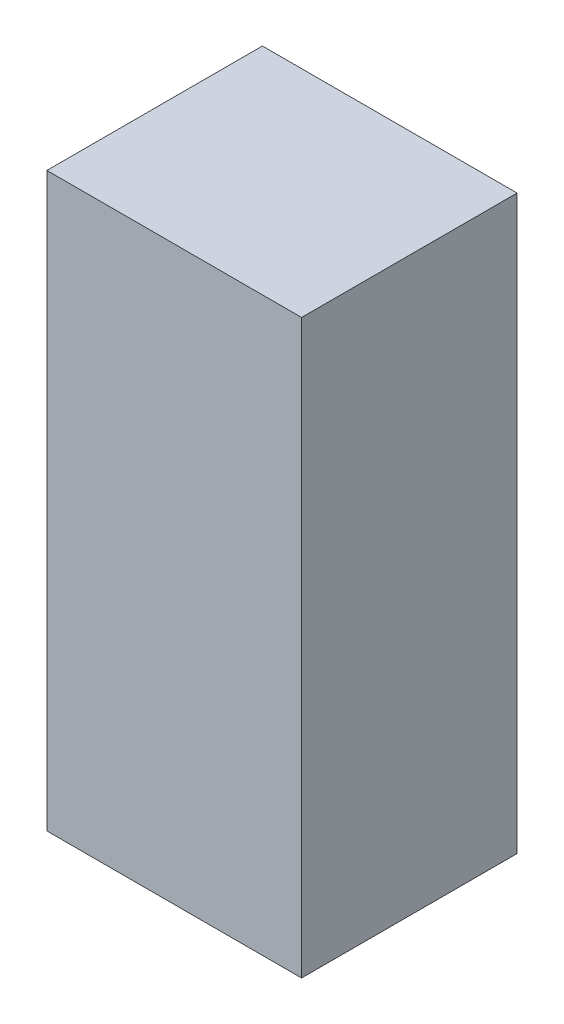
ISO-10303-21;
HEADER;
FILE_DESCRIPTION(('STEP AP214'),'2;1');
FILE_NAME('part.step','',(''),(''),'','','');
FILE_SCHEMA(('AUTOMOTIVE_DESIGN { 1 0 10303 214 1 1 1 1 }'));
ENDSEC;
DATA;
#1=APPLICATION_CONTEXT('core data for automotive mechanical design processes');
#2=APPLICATION_PROTOCOL_DEFINITION('international standard','automotive_design',2000,#1);
#3=PRODUCT_CONTEXT('',#1,'mechanical');
#4=PRODUCT('Part','Part','',(#3));
#5=PRODUCT_RELATED_PRODUCT_CATEGORY('part','',(#4));
#6=PRODUCT_DEFINITION_FORMATION('','',#4);
#7=PRODUCT_DEFINITION_CONTEXT('part definition',#1,'design');
#8=PRODUCT_DEFINITION('design','',#6,#7);
#9=PRODUCT_DEFINITION_SHAPE('','',#8);
#10=(LENGTH_UNIT() NAMED_UNIT(*) SI_UNIT(.MILLI.,.METRE.));
#11=(NAMED_UNIT(*) PLANE_ANGLE_UNIT() SI_UNIT($,.RADIAN.));
#12=(NAMED_UNIT(*) SI_UNIT($,.STERADIAN.) SOLID_ANGLE_UNIT());
#13=UNCERTAINTY_MEASURE_WITH_UNIT(LENGTH_MEASURE(1.E-05),#10,'distance_accuracy_value','');
#14=(GEOMETRIC_REPRESENTATION_CONTEXT(3) GLOBAL_UNCERTAINTY_ASSIGNED_CONTEXT((#13)) GLOBAL_UNIT_ASSIGNED_CONTEXT((#10,
#11,#12)) REPRESENTATION_CONTEXT('',''));
#15=CARTESIAN_POINT('',(0.,0.,0.));
#16=DIRECTION('',(0.,0.,1.));
#17=DIRECTION('',(1.,0.,0.));
#18=AXIS2_PLACEMENT_3D('',#15,#16,#17);
#19=CARTESIAN_POINT('',(0.65000124,-1.45999962,0.00999998));
#20=DIRECTION('',(-1.,0.,0.));
#21=DIRECTION('',(0.,1.,0.));
#22=AXIS2_PLACEMENT_3D('',#19,#20,#21);
#23=PLANE('',#22);
#24=DIRECTION('',(0.,1.,0.));
#25=VECTOR('',#24,1.);
#26=CARTESIAN_POINT('',(0.65000124,-1.45999962,0.00999998));
#27=LINE('',#26,#25);
#28=CARTESIAN_POINT('',(0.65000124,-1.45999962,0.00999998));
#29=VERTEX_POINT('',#28);
#30=CARTESIAN_POINT('',(0.65000124,1.45999962,0.00999998));
#31=VERTEX_POINT('',#30);
#32=EDGE_CURVE('E10',#29,#31,#27,.T.);
#33=ORIENTED_EDGE('',*,*,#32,.T.);
#34=DIRECTION('',(0.,0.,1.));
#35=VECTOR('',#34,1.);
#36=CARTESIAN_POINT('',(0.65000124,1.45999962,0.00999998));
#37=LINE('',#36,#35);
#38=CARTESIAN_POINT('',(0.65000124,1.45999962,1.11000032));
#39=VERTEX_POINT('',#38);
#40=EDGE_CURVE('E23',#31,#39,#37,.T.);
#41=ORIENTED_EDGE('',*,*,#40,.T.);
#42=DIRECTION('',(0.,1.,0.));
#43=VECTOR('',#42,1.);
#44=CARTESIAN_POINT('',(0.65000124,-1.45999962,1.11000032));
#45=LINE('',#44,#43);
#46=CARTESIAN_POINT('',(0.65000124,-1.45999962,1.11000032));
#47=VERTEX_POINT('',#46);
#48=EDGE_CURVE('E85',#47,#39,#45,.T.);
#49=ORIENTED_EDGE('',*,*,#48,.F.);
#50=DIRECTION('',(0.,0.,1.));
#51=VECTOR('',#50,1.);
#52=CARTESIAN_POINT('',(0.65000124,-1.45999962,0.00999998));
#53=LINE('',#52,#51);
#54=EDGE_CURVE('E33',#29,#47,#53,.T.);
#55=ORIENTED_EDGE('',*,*,#54,.F.);
#56=EDGE_LOOP('',(#33,#41,#49,#55));
#57=FACE_BOUND('',#56,.T.);
#58=ADVANCED_FACE('F16',(#57),#23,.F.);
#59=CARTESIAN_POINT('',(0.65000124,1.45999962,0.00999998));
#60=DIRECTION('',(0.,-1.,0.));
#61=DIRECTION('',(-1.,0.,0.));
#62=AXIS2_PLACEMENT_3D('',#59,#60,#61);
#63=PLANE('',#62);
#64=DIRECTION('',(-1.,0.,0.));
#65=VECTOR('',#64,1.);
#66=CARTESIAN_POINT('',(0.65000124,1.45999962,0.00999998));
#67=LINE('',#66,#65);
#68=CARTESIAN_POINT('',(-0.6499987,1.45999962,0.00999998));
#69=VERTEX_POINT('',#68);
#70=EDGE_CURVE('E82',#31,#69,#67,.T.);
#71=ORIENTED_EDGE('',*,*,#70,.T.);
#72=DIRECTION('',(0.,0.,1.));
#73=VECTOR('',#72,1.);
#74=CARTESIAN_POINT('',(-0.6499987,1.45999962,0.00999998));
#75=LINE('',#74,#73);
#76=CARTESIAN_POINT('',(-0.6499987,1.45999962,1.11000032));
#77=VERTEX_POINT('',#76);
#78=EDGE_CURVE('E80',#69,#77,#75,.T.);
#79=ORIENTED_EDGE('',*,*,#78,.T.);
#80=DIRECTION('',(-1.,0.,0.));
#81=VECTOR('',#80,1.);
#82=CARTESIAN_POINT('',(0.65000124,1.45999962,1.11000032));
#83=LINE('',#82,#81);
#84=EDGE_CURVE('E59',#39,#77,#83,.T.);
#85=ORIENTED_EDGE('',*,*,#84,.F.);
#86=ORIENTED_EDGE('',*,*,#40,.F.);
#87=EDGE_LOOP('',(#71,#79,#85,#86));
#88=FACE_BOUND('',#87,.T.);
#89=ADVANCED_FACE('F88',(#88),#63,.F.);
#90=CARTESIAN_POINT('',(-0.6499987,1.45999962,0.00999998));
#91=DIRECTION('',(1.,0.,0.));
#92=DIRECTION('',(0.,-1.,0.));
#93=AXIS2_PLACEMENT_3D('',#90,#91,#92);
#94=PLANE('',#93);
#95=DIRECTION('',(0.,-1.,0.));
#96=VECTOR('',#95,1.);
#97=CARTESIAN_POINT('',(-0.6499987,1.45999962,0.00999998));
#98=LINE('',#97,#96);
#99=CARTESIAN_POINT('',(-0.6499987,-1.45999962,0.00999998));
#100=VERTEX_POINT('',#99);
#101=EDGE_CURVE('E69',#69,#100,#98,.T.);
#102=ORIENTED_EDGE('',*,*,#101,.T.);
#103=DIRECTION('',(0.,0.,1.));
#104=VECTOR('',#103,1.);
#105=CARTESIAN_POINT('',(-0.6499987,-1.45999962,0.00999998));
#106=LINE('',#105,#104);
#107=CARTESIAN_POINT('',(-0.6499987,-1.45999962,1.11000032));
#108=VERTEX_POINT('',#107);
#109=EDGE_CURVE('E63',#100,#108,#106,.T.);
#110=ORIENTED_EDGE('',*,*,#109,.T.);
#111=DIRECTION('',(0.,-1.,0.));
#112=VECTOR('',#111,1.);
#113=CARTESIAN_POINT('',(-0.6499987,1.45999962,1.11000032));
#114=LINE('',#113,#112);
#115=EDGE_CURVE('E53',#77,#108,#114,.T.);
#116=ORIENTED_EDGE('',*,*,#115,.F.);
#117=ORIENTED_EDGE('',*,*,#78,.F.);
#118=EDGE_LOOP('',(#102,#110,#116,#117));
#119=FACE_BOUND('',#118,.T.);
#120=ADVANCED_FACE('F67',(#119),#94,.F.);
#121=CARTESIAN_POINT('',(-0.6499987,-1.45999962,0.00999998));
#122=DIRECTION('',(0.,1.,0.));
#123=DIRECTION('',(1.,0.,0.));
#124=AXIS2_PLACEMENT_3D('',#121,#122,#123);
#125=PLANE('',#124);
#126=DIRECTION('',(1.,0.,0.));
#127=VECTOR('',#126,1.);
#128=CARTESIAN_POINT('',(-0.6499987,-1.45999962,0.00999998));
#129=LINE('',#128,#127);
#130=EDGE_CURVE('E64',#100,#29,#129,.T.);
#131=ORIENTED_EDGE('',*,*,#130,.T.);
#132=ORIENTED_EDGE('',*,*,#54,.T.);
#133=DIRECTION('',(1.,0.,0.));
#134=VECTOR('',#133,1.);
#135=CARTESIAN_POINT('',(-0.6499987,-1.45999962,1.11000032));
#136=LINE('',#135,#134);
#137=EDGE_CURVE('E57',#108,#47,#136,.T.);
#138=ORIENTED_EDGE('',*,*,#137,.F.);
#139=ORIENTED_EDGE('',*,*,#109,.F.);
#140=EDGE_LOOP('',(#131,#132,#138,#139));
#141=FACE_BOUND('',#140,.T.);
#142=ADVANCED_FACE('F74',(#141),#125,.F.);
#143=CARTESIAN_POINT('',(1.269999999934E-06,0.,0.00999998));
#144=DIRECTION('',(0.,0.,1.));
#145=DIRECTION('',(-1.,0.,0.));
#146=AXIS2_PLACEMENT_3D('',#143,#144,#145);
#147=PLANE('',#146);
#148=ORIENTED_EDGE('',*,*,#130,.F.);
#149=ORIENTED_EDGE('',*,*,#101,.F.);
#150=ORIENTED_EDGE('',*,*,#70,.F.);
#151=ORIENTED_EDGE('',*,*,#32,.F.);
#152=EDGE_LOOP('',(#148,#149,#150,#151));
#153=FACE_BOUND('',#152,.T.);
#154=ADVANCED_FACE('F90',(#153),#147,.F.);
#155=CARTESIAN_POINT('',(1.269999999934E-06,0.,1.11000032));
#156=DIRECTION('',(0.,0.,1.));
#157=DIRECTION('',(-1.,0.,0.));
#158=AXIS2_PLACEMENT_3D('',#155,#156,#157);
#159=PLANE('',#158);
#160=ORIENTED_EDGE('',*,*,#48,.T.);
#161=ORIENTED_EDGE('',*,*,#84,.T.);
#162=ORIENTED_EDGE('',*,*,#115,.T.);
#163=ORIENTED_EDGE('',*,*,#137,.T.);
#164=EDGE_LOOP('',(#160,#161,#162,#163));
#165=FACE_BOUND('',#164,.T.);
#166=ADVANCED_FACE('F55',(#165),#159,.T.);
#167=CLOSED_SHELL('',(#58,#89,#120,#142,#154,#166));
#168=MANIFOLD_SOLID_BREP('B1',#167);
#169=ADVANCED_BREP_SHAPE_REPRESENTATION('',(#18,#168),#14);
#170=SHAPE_DEFINITION_REPRESENTATION(#9,#169);
ENDSEC;
END-ISO-10303-21;
